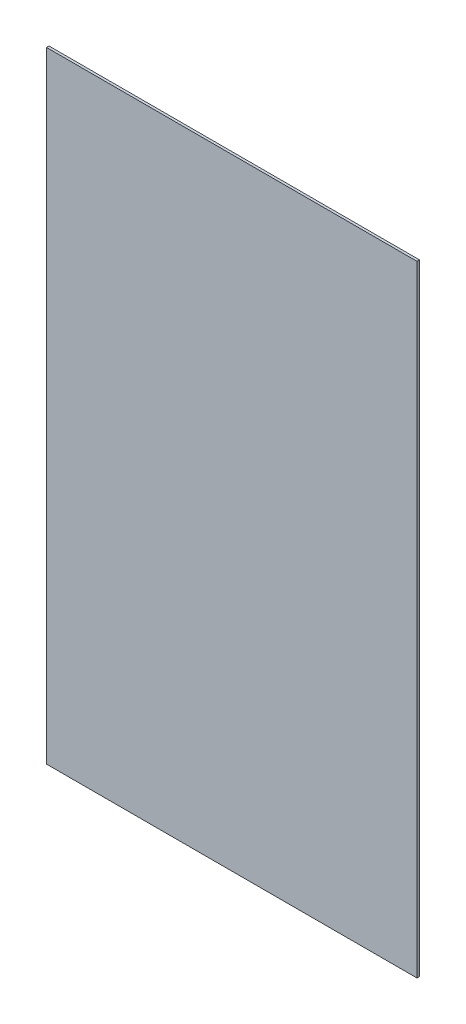
ISO-10303-21;
HEADER;
FILE_DESCRIPTION(('STEP AP214'),'2;1');
FILE_NAME('part.step','',(''),(''),'','','');
FILE_SCHEMA(('AUTOMOTIVE_DESIGN { 1 0 10303 214 1 1 1 1 }'));
ENDSEC;
DATA;
#1=APPLICATION_CONTEXT('core data for automotive mechanical design processes');
#2=APPLICATION_PROTOCOL_DEFINITION('international standard','automotive_design',2000,#1);
#3=PRODUCT_CONTEXT('',#1,'mechanical');
#4=PRODUCT('Part','Part','',(#3));
#5=PRODUCT_RELATED_PRODUCT_CATEGORY('part','',(#4));
#6=PRODUCT_DEFINITION_FORMATION('','',#4);
#7=PRODUCT_DEFINITION_CONTEXT('part definition',#1,'design');
#8=PRODUCT_DEFINITION('design','',#6,#7);
#9=PRODUCT_DEFINITION_SHAPE('','',#8);
#10=(LENGTH_UNIT() NAMED_UNIT(*) SI_UNIT(.MILLI.,.METRE.));
#11=(NAMED_UNIT(*) PLANE_ANGLE_UNIT() SI_UNIT($,.RADIAN.));
#12=(NAMED_UNIT(*) SI_UNIT($,.STERADIAN.) SOLID_ANGLE_UNIT());
#13=UNCERTAINTY_MEASURE_WITH_UNIT(LENGTH_MEASURE(1.E-05),#10,'distance_accuracy_value','');
#14=(GEOMETRIC_REPRESENTATION_CONTEXT(3) GLOBAL_UNCERTAINTY_ASSIGNED_CONTEXT((#13)) GLOBAL_UNIT_ASSIGNED_CONTEXT((#10,
#11,#12)) REPRESENTATION_CONTEXT('',''));
#15=CARTESIAN_POINT('',(0.,0.,0.));
#16=DIRECTION('',(0.,0.,1.));
#17=DIRECTION('',(1.,0.,0.));
#18=AXIS2_PLACEMENT_3D('',#15,#16,#17);
#19=CARTESIAN_POINT('',(0.,0.,0.));
#20=DIRECTION('',(0.,0.,-1.));
#21=DIRECTION('',(0.,1.,0.));
#22=AXIS2_PLACEMENT_3D('',#19,#20,#21);
#23=PLANE('',#22);
#24=DIRECTION('',(0.,-1.,0.));
#25=VECTOR('',#24,1.);
#26=CARTESIAN_POINT('',(211.963264780348,278.697874425179,0.));
#27=LINE('',#26,#25);
#28=CARTESIAN_POINT('',(211.963264780348,278.697874425179,0.));
#29=VERTEX_POINT('',#28);
#30=CARTESIAN_POINT('',(211.963264780345,-217.302125574821,0.));
#31=VERTEX_POINT('',#30);
#32=EDGE_CURVE('E54',#29,#31,#27,.T.);
#33=ORIENTED_EDGE('',*,*,#32,.T.);
#34=DIRECTION('',(-1.,0.,0.));
#35=VECTOR('',#34,1.);
#36=CARTESIAN_POINT('',(211.963264780344,-217.302125574821,0.));
#37=LINE('',#36,#35);
#38=CARTESIAN_POINT('',(-84.0367352196653,-217.302125574822,0.));
#39=VERTEX_POINT('',#38);
#40=EDGE_CURVE('E75',#31,#39,#37,.T.);
#41=ORIENTED_EDGE('',*,*,#40,.T.);
#42=DIRECTION('',(0.,1.,0.));
#43=VECTOR('',#42,1.);
#44=CARTESIAN_POINT('',(-84.0367352196601,278.697874425179,0.));
#45=LINE('',#44,#43);
#46=CARTESIAN_POINT('',(-84.0367352196615,278.697874425178,0.));
#47=VERTEX_POINT('',#46);
#48=EDGE_CURVE('E57',#39,#47,#45,.T.);
#49=ORIENTED_EDGE('',*,*,#48,.T.);
#50=DIRECTION('',(1.,0.,0.));
#51=VECTOR('',#50,1.);
#52=CARTESIAN_POINT('',(211.963264780348,278.697874425179,0.));
#53=LINE('',#52,#51);
#54=EDGE_CURVE('E19',#47,#29,#53,.T.);
#55=ORIENTED_EDGE('',*,*,#54,.T.);
#56=EDGE_LOOP('',(#33,#41,#49,#55));
#57=FACE_BOUND('',#56,.T.);
#58=ADVANCED_FACE('F16',(#57),#23,.T.);
#59=CARTESIAN_POINT('',(211.963264780348,278.697874425179,2.));
#60=DIRECTION('',(0.,-1.,0.));
#61=DIRECTION('',(1.,0.,0.));
#62=AXIS2_PLACEMENT_3D('',#59,#60,#61);
#63=PLANE('',#62);
#64=DIRECTION('',(0.,0.,1.));
#65=VECTOR('',#64,1.);
#66=CARTESIAN_POINT('',(-84.0367352196601,278.697874425179,2.));
#67=LINE('',#66,#65);
#68=CARTESIAN_POINT('',(-84.0367352196615,278.697874425178,2.));
#69=VERTEX_POINT('',#68);
#70=EDGE_CURVE('E77',#47,#69,#67,.T.);
#71=ORIENTED_EDGE('',*,*,#70,.T.);
#72=DIRECTION('',(1.,0.,0.));
#73=VECTOR('',#72,1.);
#74=CARTESIAN_POINT('',(0.,278.697874425179,2.));
#75=LINE('',#74,#73);
#76=CARTESIAN_POINT('',(211.963264780348,278.697874425179,2.));
#77=VERTEX_POINT('',#76);
#78=EDGE_CURVE('E72',#69,#77,#75,.T.);
#79=ORIENTED_EDGE('',*,*,#78,.T.);
#80=DIRECTION('',(0.,0.,1.));
#81=VECTOR('',#80,1.);
#82=CARTESIAN_POINT('',(211.963264780348,278.697874425179,2.));
#83=LINE('',#82,#81);
#84=EDGE_CURVE('E62',#77,#29,#83,.F.);
#85=ORIENTED_EDGE('',*,*,#84,.T.);
#86=ORIENTED_EDGE('',*,*,#54,.F.);
#87=EDGE_LOOP('',(#71,#79,#85,#86));
#88=FACE_BOUND('',#87,.T.);
#89=ADVANCED_FACE('F71',(#88),#63,.F.);
#90=CARTESIAN_POINT('',(211.963264780348,278.697874425179,2.));
#91=DIRECTION('',(-1.,0.,0.));
#92=DIRECTION('',(0.,-1.,0.));
#93=AXIS2_PLACEMENT_3D('',#90,#91,#92);
#94=PLANE('',#93);
#95=ORIENTED_EDGE('',*,*,#84,.F.);
#96=DIRECTION('',(0.,1.,0.));
#97=VECTOR('',#96,1.);
#98=CARTESIAN_POINT('',(211.963264780348,0.,2.));
#99=LINE('',#98,#97);
#100=CARTESIAN_POINT('',(211.963264780345,-217.302125574821,2.));
#101=VERTEX_POINT('',#100);
#102=EDGE_CURVE('E82',#77,#101,#99,.F.);
#103=ORIENTED_EDGE('',*,*,#102,.T.);
#104=DIRECTION('',(0.,0.,1.));
#105=VECTOR('',#104,1.);
#106=CARTESIAN_POINT('',(211.963264780344,-217.302125574821,2.));
#107=LINE('',#106,#105);
#108=EDGE_CURVE('E68',#101,#31,#107,.F.);
#109=ORIENTED_EDGE('',*,*,#108,.T.);
#110=ORIENTED_EDGE('',*,*,#32,.F.);
#111=EDGE_LOOP('',(#95,#103,#109,#110));
#112=FACE_BOUND('',#111,.T.);
#113=ADVANCED_FACE('F65',(#112),#94,.F.);
#114=CARTESIAN_POINT('',(211.963264780344,-217.302125574821,2.));
#115=DIRECTION('',(0.,1.,0.));
#116=DIRECTION('',(-1.,0.,0.));
#117=AXIS2_PLACEMENT_3D('',#114,#115,#116);
#118=PLANE('',#117);
#119=ORIENTED_EDGE('',*,*,#108,.F.);
#120=DIRECTION('',(1.,0.,0.));
#121=VECTOR('',#120,1.);
#122=CARTESIAN_POINT('',(0.,-217.302125574821,2.));
#123=LINE('',#122,#121);
#124=CARTESIAN_POINT('',(-84.0367352196653,-217.302125574822,2.));
#125=VERTEX_POINT('',#124);
#126=EDGE_CURVE('E25',#101,#125,#123,.F.);
#127=ORIENTED_EDGE('',*,*,#126,.T.);
#128=DIRECTION('',(0.,0.,1.));
#129=VECTOR('',#128,1.);
#130=CARTESIAN_POINT('',(-84.0367352196644,-217.302125574821,2.));
#131=LINE('',#130,#129);
#132=EDGE_CURVE('E33',#125,#39,#131,.F.);
#133=ORIENTED_EDGE('',*,*,#132,.T.);
#134=ORIENTED_EDGE('',*,*,#40,.F.);
#135=EDGE_LOOP('',(#119,#127,#133,#134));
#136=FACE_BOUND('',#135,.T.);
#137=ADVANCED_FACE('F87',(#136),#118,.F.);
#138=CARTESIAN_POINT('',(-84.0367352196601,278.697874425179,2.));
#139=DIRECTION('',(1.,0.,0.));
#140=DIRECTION('',(0.,1.,0.));
#141=AXIS2_PLACEMENT_3D('',#138,#139,#140);
#142=PLANE('',#141);
#143=ORIENTED_EDGE('',*,*,#132,.F.);
#144=DIRECTION('',(0.,1.,0.));
#145=VECTOR('',#144,1.);
#146=CARTESIAN_POINT('',(-84.0367352196655,0.,2.));
#147=LINE('',#146,#145);
#148=EDGE_CURVE('E11',#125,#69,#147,.T.);
#149=ORIENTED_EDGE('',*,*,#148,.T.);
#150=ORIENTED_EDGE('',*,*,#70,.F.);
#151=ORIENTED_EDGE('',*,*,#48,.F.);
#152=EDGE_LOOP('',(#143,#149,#150,#151));
#153=FACE_BOUND('',#152,.T.);
#154=ADVANCED_FACE('F90',(#153),#142,.F.);
#155=CARTESIAN_POINT('',(0.,0.,2.));
#156=DIRECTION('',(0.,0.,-1.));
#157=DIRECTION('',(0.,1.,0.));
#158=AXIS2_PLACEMENT_3D('',#155,#156,#157);
#159=PLANE('',#158);
#160=ORIENTED_EDGE('',*,*,#126,.F.);
#161=ORIENTED_EDGE('',*,*,#102,.F.);
#162=ORIENTED_EDGE('',*,*,#78,.F.);
#163=ORIENTED_EDGE('',*,*,#148,.F.);
#164=EDGE_LOOP('',(#160,#161,#162,#163));
#165=FACE_BOUND('',#164,.T.);
#166=ADVANCED_FACE('F89',(#165),#159,.F.);
#167=CLOSED_SHELL('',(#58,#89,#113,#137,#154,#166));
#168=MANIFOLD_SOLID_BREP('B1',#167);
#169=ADVANCED_BREP_SHAPE_REPRESENTATION('',(#18,#168),#14);
#170=SHAPE_DEFINITION_REPRESENTATION(#9,#169);
ENDSEC;
END-ISO-10303-21;
